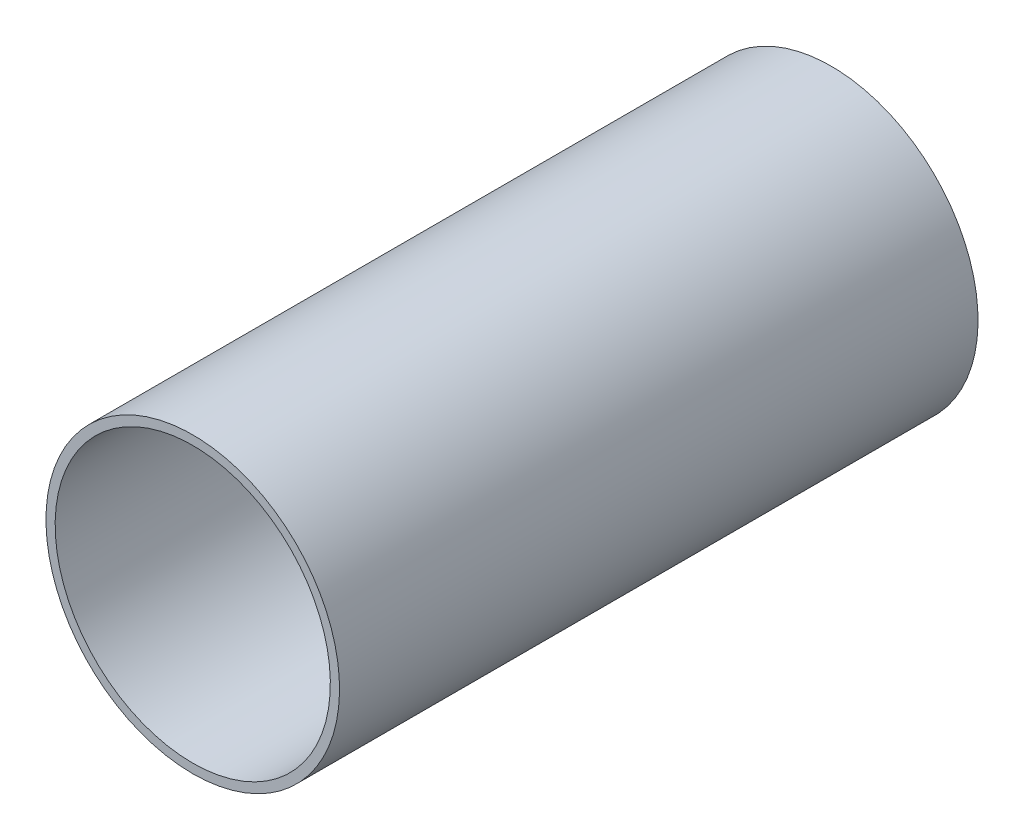
ISO-10303-21;
HEADER;
FILE_DESCRIPTION(('STEP AP214'),'2;1');
FILE_NAME('part.step','',(''),(''),'','','');
FILE_SCHEMA(('AUTOMOTIVE_DESIGN { 1 0 10303 214 1 1 1 1 }'));
ENDSEC;
DATA;
#1=APPLICATION_CONTEXT('core data for automotive mechanical design processes');
#2=APPLICATION_PROTOCOL_DEFINITION('international standard','automotive_design',2000,#1);
#3=PRODUCT_CONTEXT('',#1,'mechanical');
#4=PRODUCT('Part','Part','',(#3));
#5=PRODUCT_RELATED_PRODUCT_CATEGORY('part','',(#4));
#6=PRODUCT_DEFINITION_FORMATION('','',#4);
#7=PRODUCT_DEFINITION_CONTEXT('part definition',#1,'design');
#8=PRODUCT_DEFINITION('design','',#6,#7);
#9=PRODUCT_DEFINITION_SHAPE('','',#8);
#10=(LENGTH_UNIT() NAMED_UNIT(*) SI_UNIT(.MILLI.,.METRE.));
#11=(NAMED_UNIT(*) PLANE_ANGLE_UNIT() SI_UNIT($,.RADIAN.));
#12=(NAMED_UNIT(*) SI_UNIT($,.STERADIAN.) SOLID_ANGLE_UNIT());
#13=UNCERTAINTY_MEASURE_WITH_UNIT(LENGTH_MEASURE(1.E-05),#10,'distance_accuracy_value','');
#14=(GEOMETRIC_REPRESENTATION_CONTEXT(3) GLOBAL_UNCERTAINTY_ASSIGNED_CONTEXT((#13)) GLOBAL_UNIT_ASSIGNED_CONTEXT((#10,
#11,#12)) REPRESENTATION_CONTEXT('',''));
#15=CARTESIAN_POINT('',(0.,0.,0.));
#16=DIRECTION('',(0.,0.,1.));
#17=DIRECTION('',(1.,0.,0.));
#18=AXIS2_PLACEMENT_3D('',#15,#16,#17);
#19=CARTESIAN_POINT('',(143.764,-73.152,-0.045));
#20=DIRECTION('',(0.,0.,-1.));
#21=DIRECTION('',(0.,-1.,0.));
#22=AXIS2_PLACEMENT_3D('',#19,#20,#21);
#23=CYLINDRICAL_SURFACE('',#22,0.375);
#24=CARTESIAN_POINT('',(143.764,-73.152,-0.035));
#25=DIRECTION('',(0.,0.,-1.));
#26=DIRECTION('',(0.,-1.,0.));
#27=AXIS2_PLACEMENT_3D('',#24,#25,#26);
#28=CIRCLE('',#27,0.375);
#29=CARTESIAN_POINT('',(143.764,-73.527,-0.035));
#30=VERTEX_POINT('',#29);
#31=EDGE_CURVE('E64',#30,#30,#28,.T.);
#32=ORIENTED_EDGE('',*,*,#31,.T.);
#33=DIRECTION('',(0.,0.,1.));
#34=VECTOR('',#33,1.);
#35=CARTESIAN_POINT('',(143.764,-73.527,-0.045));
#36=LINE('',#35,#34);
#37=CARTESIAN_POINT('',(143.764,-73.527,1.705));
#38=VERTEX_POINT('',#37);
#39=EDGE_CURVE('E11',#30,#38,#36,.T.);
#40=ORIENTED_EDGE('',*,*,#39,.T.);
#41=CARTESIAN_POINT('',(143.764,-73.152,1.705));
#42=DIRECTION('',(0.,0.,-1.));
#43=DIRECTION('',(0.,-1.,0.));
#44=AXIS2_PLACEMENT_3D('',#41,#42,#43);
#45=CIRCLE('',#44,0.375);
#46=EDGE_CURVE('E20',#38,#38,#45,.T.);
#47=ORIENTED_EDGE('',*,*,#46,.F.);
#48=ORIENTED_EDGE('',*,*,#39,.F.);
#49=EDGE_LOOP('',(#32,#40,#47,#48));
#50=FACE_BOUND('',#49,.T.);
#51=ADVANCED_FACE('F17',(#50),#23,.F.);
#52=CARTESIAN_POINT('',(143.764,-73.552,1.705));
#53=DIRECTION('',(0.,0.,1.));
#54=DIRECTION('',(1.,0.,0.));
#55=AXIS2_PLACEMENT_3D('',#52,#53,#54);
#56=PLANE('',#55);
#57=ORIENTED_EDGE('',*,*,#46,.T.);
#58=EDGE_LOOP('',(#57));
#59=FACE_BOUND('',#58,.T.);
#60=CARTESIAN_POINT('',(143.764,-73.152,1.705));
#61=DIRECTION('',(0.,0.,1.));
#62=DIRECTION('',(0.,-1.,0.));
#63=AXIS2_PLACEMENT_3D('',#60,#61,#62);
#64=CIRCLE('',#63,0.4);
#65=CARTESIAN_POINT('',(143.764,-73.552,1.705));
#66=VERTEX_POINT('',#65);
#67=EDGE_CURVE('E56',#66,#66,#64,.T.);
#68=ORIENTED_EDGE('',*,*,#67,.T.);
#69=EDGE_LOOP('',(#68));
#70=FACE_BOUND('',#69,.T.);
#71=ADVANCED_FACE('F76',(#59,#70),#56,.T.);
#72=CARTESIAN_POINT('',(143.764,-73.552,-0.035));
#73=DIRECTION('',(0.,0.,1.));
#74=DIRECTION('',(1.,0.,0.));
#75=AXIS2_PLACEMENT_3D('',#72,#73,#74);
#76=PLANE('',#75);
#77=ORIENTED_EDGE('',*,*,#31,.F.);
#78=EDGE_LOOP('',(#77));
#79=FACE_BOUND('',#78,.T.);
#80=CARTESIAN_POINT('',(143.764,-73.152,-0.035));
#81=DIRECTION('',(0.,0.,1.));
#82=DIRECTION('',(0.,-1.,0.));
#83=AXIS2_PLACEMENT_3D('',#80,#81,#82);
#84=CIRCLE('',#83,0.4);
#85=CARTESIAN_POINT('',(143.764,-73.552,-0.035));
#86=VERTEX_POINT('',#85);
#87=EDGE_CURVE('E55',#86,#86,#84,.T.);
#88=ORIENTED_EDGE('',*,*,#87,.F.);
#89=EDGE_LOOP('',(#88));
#90=FACE_BOUND('',#89,.T.);
#91=ADVANCED_FACE('F84',(#79,#90),#76,.F.);
#92=CARTESIAN_POINT('',(143.764,-73.152,-0.035));
#93=DIRECTION('',(0.,0.,-1.));
#94=DIRECTION('',(0.,-1.,0.));
#95=AXIS2_PLACEMENT_3D('',#92,#93,#94);
#96=CYLINDRICAL_SURFACE('',#95,0.4);
#97=ORIENTED_EDGE('',*,*,#87,.T.);
#98=DIRECTION('',(0.,0.,1.));
#99=VECTOR('',#98,1.);
#100=CARTESIAN_POINT('',(143.764,-73.552,-0.035));
#101=LINE('',#100,#99);
#102=EDGE_CURVE('E52',#86,#66,#101,.T.);
#103=ORIENTED_EDGE('',*,*,#102,.T.);
#104=ORIENTED_EDGE('',*,*,#67,.F.);
#105=ORIENTED_EDGE('',*,*,#102,.F.);
#106=EDGE_LOOP('',(#97,#103,#104,#105));
#107=FACE_BOUND('',#106,.T.);
#108=ADVANCED_FACE('F53',(#107),#96,.T.);
#109=CLOSED_SHELL('',(#51,#71,#91,#108));
#110=MANIFOLD_SOLID_BREP('B1',#109);
#111=ADVANCED_BREP_SHAPE_REPRESENTATION('',(#18,#110),#14);
#112=SHAPE_DEFINITION_REPRESENTATION(#9,#111);
ENDSEC;
END-ISO-10303-21;
